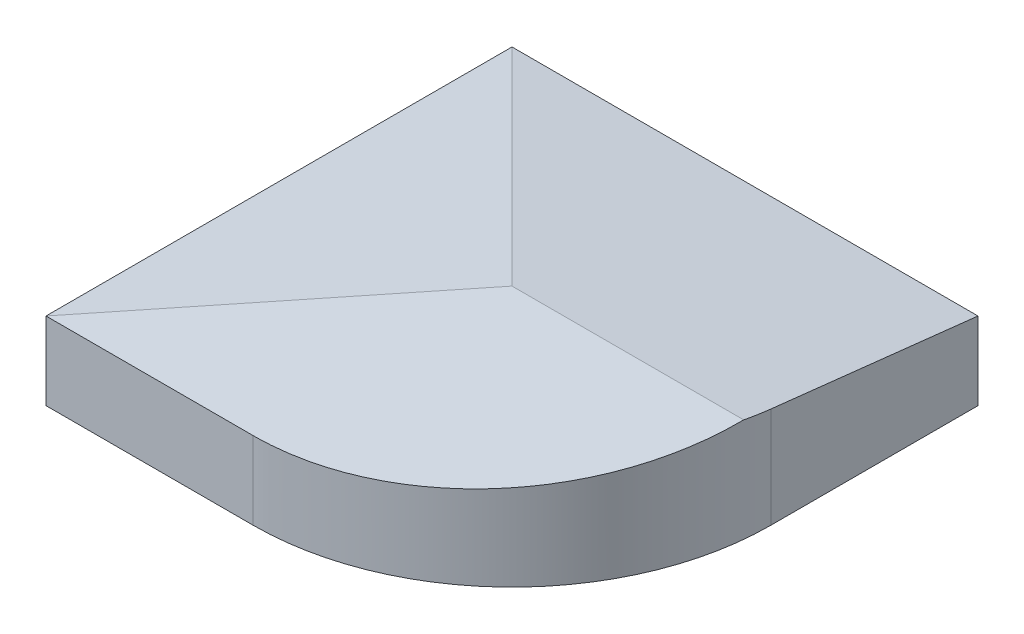
ISO-10303-21;
HEADER;
FILE_DESCRIPTION(('STEP AP214'),'2;1');
FILE_NAME('part.step','',(''),(''),'','','');
FILE_SCHEMA(('AUTOMOTIVE_DESIGN { 1 0 10303 214 1 1 1 1 }'));
ENDSEC;
DATA;
#1=APPLICATION_CONTEXT('core data for automotive mechanical design processes');
#2=APPLICATION_PROTOCOL_DEFINITION('international standard','automotive_design',2000,#1);
#3=PRODUCT_CONTEXT('',#1,'mechanical');
#4=PRODUCT('Part','Part','',(#3));
#5=PRODUCT_RELATED_PRODUCT_CATEGORY('part','',(#4));
#6=PRODUCT_DEFINITION_FORMATION('','',#4);
#7=PRODUCT_DEFINITION_CONTEXT('part definition',#1,'design');
#8=PRODUCT_DEFINITION('design','',#6,#7);
#9=PRODUCT_DEFINITION_SHAPE('','',#8);
#10=(LENGTH_UNIT() NAMED_UNIT(*) SI_UNIT(.MILLI.,.METRE.));
#11=(NAMED_UNIT(*) PLANE_ANGLE_UNIT() SI_UNIT($,.RADIAN.));
#12=(NAMED_UNIT(*) SI_UNIT($,.STERADIAN.) SOLID_ANGLE_UNIT());
#13=UNCERTAINTY_MEASURE_WITH_UNIT(LENGTH_MEASURE(1.E-05),#10,'distance_accuracy_value','');
#14=(GEOMETRIC_REPRESENTATION_CONTEXT(3) GLOBAL_UNCERTAINTY_ASSIGNED_CONTEXT((#13)) GLOBAL_UNIT_ASSIGNED_CONTEXT((#10,
#11,#12)) REPRESENTATION_CONTEXT('',''));
#15=CARTESIAN_POINT('',(0.,0.,0.));
#16=DIRECTION('',(0.,0.,1.));
#17=DIRECTION('',(1.,0.,0.));
#18=AXIS2_PLACEMENT_3D('',#15,#16,#17);
#19=CARTESIAN_POINT('',(900.,200.,-900.));
#20=DIRECTION('',(0.,0.,1.));
#21=DIRECTION('',(1.,0.,0.));
#22=AXIS2_PLACEMENT_3D('',#19,#20,#21);
#23=PLANE('',#22);
#24=DIRECTION('',(0.,-1.,0.));
#25=VECTOR('',#24,1.);
#26=CARTESIAN_POINT('',(0.,200.,-900.));
#27=LINE('',#26,#25);
#28=CARTESIAN_POINT('',(0.,150.,-900.));
#29=VERTEX_POINT('',#28);
#30=CARTESIAN_POINT('',(0.,0.,-900.));
#31=VERTEX_POINT('',#30);
#32=EDGE_CURVE('E206',#29,#31,#27,.T.);
#33=ORIENTED_EDGE('',*,*,#32,.F.);
#34=DIRECTION('',(-1.,0.,0.));
#35=VECTOR('',#34,1.);
#36=CARTESIAN_POINT('',(900.,150.,-900.));
#37=LINE('',#36,#35);
#38=CARTESIAN_POINT('',(900.,150.,-900.));
#39=VERTEX_POINT('',#38);
#40=EDGE_CURVE('E186',#39,#29,#37,.T.);
#41=ORIENTED_EDGE('',*,*,#40,.F.);
#42=DIRECTION('',(0.,-1.,0.));
#43=VECTOR('',#42,1.);
#44=CARTESIAN_POINT('',(900.,200.,-900.));
#45=LINE('',#44,#43);
#46=CARTESIAN_POINT('',(900.,0.,-900.));
#47=VERTEX_POINT('',#46);
#48=EDGE_CURVE('E202',#39,#47,#45,.T.);
#49=ORIENTED_EDGE('',*,*,#48,.T.);
#50=DIRECTION('',(-1.,0.,0.));
#51=VECTOR('',#50,1.);
#52=CARTESIAN_POINT('',(900.,0.,-900.));
#53=LINE('',#52,#51);
#54=EDGE_CURVE('E189',#47,#31,#53,.T.);
#55=ORIENTED_EDGE('',*,*,#54,.T.);
#56=EDGE_LOOP('',(#33,#41,#49,#55));
#57=FACE_BOUND('',#56,.T.);
#58=ADVANCED_FACE('F33',(#57),#23,.F.);
#59=CARTESIAN_POINT('',(0.,200.,-900.));
#60=DIRECTION('',(1.,0.,0.));
#61=DIRECTION('',(0.,0.,-1.));
#62=AXIS2_PLACEMENT_3D('',#59,#60,#61);
#63=PLANE('',#62);
#64=DIRECTION('',(0.,-1.,0.));
#65=VECTOR('',#64,1.);
#66=CARTESIAN_POINT('',(0.,200.,0.));
#67=LINE('',#66,#65);
#68=CARTESIAN_POINT('',(0.,150.,0.));
#69=VERTEX_POINT('',#68);
#70=CARTESIAN_POINT('',(0.,0.,0.));
#71=VERTEX_POINT('',#70);
#72=EDGE_CURVE('E204',#69,#71,#67,.T.);
#73=ORIENTED_EDGE('',*,*,#72,.F.);
#74=DIRECTION('',(0.,0.,-1.));
#75=VECTOR('',#74,1.);
#76=CARTESIAN_POINT('',(0.,150.,1.11022302462516E-13));
#77=LINE('',#76,#75);
#78=EDGE_CURVE('E180',#69,#29,#77,.T.);
#79=ORIENTED_EDGE('',*,*,#78,.T.);
#80=ORIENTED_EDGE('',*,*,#32,.T.);
#81=DIRECTION('',(0.,0.,1.));
#82=VECTOR('',#81,1.);
#83=CARTESIAN_POINT('',(0.,0.,-900.));
#84=LINE('',#83,#82);
#85=EDGE_CURVE('E193',#31,#71,#84,.T.);
#86=ORIENTED_EDGE('',*,*,#85,.T.);
#87=EDGE_LOOP('',(#73,#79,#80,#86));
#88=FACE_BOUND('',#87,.T.);
#89=ADVANCED_FACE('F227',(#88),#63,.F.);
#90=CARTESIAN_POINT('',(900.,200.,0.));
#91=DIRECTION('',(0.,0.,-1.));
#92=DIRECTION('',(-1.,0.,0.));
#93=AXIS2_PLACEMENT_3D('',#90,#91,#92);
#94=PLANE('',#93);
#95=DIRECTION('',(0.,-1.,0.));
#96=VECTOR('',#95,1.);
#97=CARTESIAN_POINT('',(400.,200.,0.));
#98=LINE('',#97,#96);
#99=CARTESIAN_POINT('',(400.,0.,0.));
#100=VERTEX_POINT('',#99);
#101=CARTESIAN_POINT('',(400.,150.,0.));
#102=VERTEX_POINT('',#101);
#103=EDGE_CURVE('E212',#100,#102,#98,.F.);
#104=ORIENTED_EDGE('',*,*,#103,.T.);
#105=DIRECTION('',(1.,0.,0.));
#106=VECTOR('',#105,1.);
#107=CARTESIAN_POINT('',(0.,150.,0.));
#108=LINE('',#107,#106);
#109=EDGE_CURVE('E166',#69,#102,#108,.T.);
#110=ORIENTED_EDGE('',*,*,#109,.F.);
#111=ORIENTED_EDGE('',*,*,#72,.T.);
#112=DIRECTION('',(1.,0.,0.));
#113=VECTOR('',#112,1.);
#114=CARTESIAN_POINT('',(900.,0.,0.));
#115=LINE('',#114,#113);
#116=EDGE_CURVE('E196',#71,#100,#115,.T.);
#117=ORIENTED_EDGE('',*,*,#116,.T.);
#118=EDGE_LOOP('',(#104,#110,#111,#117));
#119=FACE_BOUND('',#118,.T.);
#120=ADVANCED_FACE('F232',(#119),#94,.F.);
#121=CARTESIAN_POINT('',(900.,200.,-900.));
#122=DIRECTION('',(-1.,0.,0.));
#123=DIRECTION('',(0.,0.,1.));
#124=AXIS2_PLACEMENT_3D('',#121,#122,#123);
#125=PLANE('',#124);
#126=ORIENTED_EDGE('',*,*,#48,.F.);
#127=DIRECTION('',(0.,0.110431526074847,0.993883734673619));
#128=VECTOR('',#127,1.);
#129=CARTESIAN_POINT('',(900.,200.,-450.));
#130=LINE('',#129,#128);
#131=CARTESIAN_POINT('',(900.,194.444444444444,-500.));
#132=VERTEX_POINT('',#131);
#133=EDGE_CURVE('E183',#39,#132,#130,.T.);
#134=ORIENTED_EDGE('',*,*,#133,.T.);
#135=DIRECTION('',(0.,-1.,0.));
#136=VECTOR('',#135,1.);
#137=CARTESIAN_POINT('',(900.,200.,-500.));
#138=LINE('',#137,#136);
#139=CARTESIAN_POINT('',(900.,0.,-500.));
#140=VERTEX_POINT('',#139);
#141=EDGE_CURVE('E208',#132,#140,#138,.T.);
#142=ORIENTED_EDGE('',*,*,#141,.T.);
#143=DIRECTION('',(0.,0.,-1.));
#144=VECTOR('',#143,1.);
#145=CARTESIAN_POINT('',(900.,0.,-900.));
#146=LINE('',#145,#144);
#147=EDGE_CURVE('E199',#140,#47,#146,.T.);
#148=ORIENTED_EDGE('',*,*,#147,.T.);
#149=EDGE_LOOP('',(#126,#134,#142,#148));
#150=FACE_BOUND('',#149,.T.);
#151=ADVANCED_FACE('F241',(#150),#125,.F.);
#152=CARTESIAN_POINT('',(0.,0.,0.));
#153=DIRECTION('',(0.,1.,0.));
#154=DIRECTION('',(0.,0.,1.));
#155=AXIS2_PLACEMENT_3D('',#152,#153,#154);
#156=PLANE('',#155);
#157=CARTESIAN_POINT('',(400.,0.,-500.));
#158=DIRECTION('',(0.,1.,0.));
#159=DIRECTION('',(0.,0.,1.));
#160=AXIS2_PLACEMENT_3D('',#157,#158,#159);
#161=CIRCLE('',#160,430.);
#162=CARTESIAN_POINT('',(830.,0.,-500.));
#163=VERTEX_POINT('',#162);
#164=CARTESIAN_POINT('',(400.,0.,-70.));
#165=VERTEX_POINT('',#164);
#166=EDGE_CURVE('E145',#163,#165,#161,.F.);
#167=ORIENTED_EDGE('',*,*,#166,.F.);
#168=DIRECTION('',(0.,0.,-1.));
#169=VECTOR('',#168,1.);
#170=CARTESIAN_POINT('',(830.,0.,-900.));
#171=LINE('',#170,#169);
#172=CARTESIAN_POINT('',(830.,0.,-830.));
#173=VERTEX_POINT('',#172);
#174=EDGE_CURVE('E170',#163,#173,#171,.T.);
#175=ORIENTED_EDGE('',*,*,#174,.T.);
#176=DIRECTION('',(-1.,0.,0.));
#177=VECTOR('',#176,1.);
#178=CARTESIAN_POINT('',(900.,0.,-830.));
#179=LINE('',#178,#177);
#180=CARTESIAN_POINT('',(70.,0.,-830.));
#181=VERTEX_POINT('',#180);
#182=EDGE_CURVE('E167',#173,#181,#179,.T.);
#183=ORIENTED_EDGE('',*,*,#182,.T.);
#184=DIRECTION('',(0.,0.,1.));
#185=VECTOR('',#184,1.);
#186=CARTESIAN_POINT('',(70.,0.,-900.));
#187=LINE('',#186,#185);
#188=CARTESIAN_POINT('',(70.,0.,-70.));
#189=VERTEX_POINT('',#188);
#190=EDGE_CURVE('E48',#181,#189,#187,.T.);
#191=ORIENTED_EDGE('',*,*,#190,.T.);
#192=DIRECTION('',(1.,0.,0.));
#193=VECTOR('',#192,1.);
#194=CARTESIAN_POINT('',(900.,0.,-70.));
#195=LINE('',#194,#193);
#196=EDGE_CURVE('E173',#189,#165,#195,.T.);
#197=ORIENTED_EDGE('',*,*,#196,.T.);
#198=EDGE_LOOP('',(#167,#175,#183,#191,#197));
#199=FACE_BOUND('',#198,.T.);
#200=ORIENTED_EDGE('',*,*,#147,.F.);
#201=CARTESIAN_POINT('',(400.,0.,-500.));
#202=DIRECTION('',(0.,1.,0.));
#203=DIRECTION('',(0.,0.,1.));
#204=AXIS2_PLACEMENT_3D('',#201,#202,#203);
#205=CIRCLE('',#204,500.);
#206=EDGE_CURVE('E210',#140,#100,#205,.F.);
#207=ORIENTED_EDGE('',*,*,#206,.T.);
#208=ORIENTED_EDGE('',*,*,#116,.F.);
#209=ORIENTED_EDGE('',*,*,#85,.F.);
#210=ORIENTED_EDGE('',*,*,#54,.F.);
#211=EDGE_LOOP('',(#200,#207,#208,#209,#210));
#212=FACE_BOUND('',#211,.T.);
#213=ADVANCED_FACE('F246',(#199,#212),#156,.F.);
#214=CARTESIAN_POINT('',(400.,200.,-500.));
#215=DIRECTION('',(0.,-1.,0.));
#216=DIRECTION('',(0.,0.,-1.));
#217=AXIS2_PLACEMENT_3D('',#214,#215,#216);
#218=CYLINDRICAL_SURFACE('',#217,500.);
#219=CARTESIAN_POINT('',(400.,205.555555555556,-500.));
#220=DIRECTION('',(0.,-0.993883734673619,-0.110431526074847));
#221=DIRECTION('',(0.,-0.110431526074847,0.993883734673619));
#222=AXIS2_PLACEMENT_3D('',#219,#220,#221);
#223=ELLIPSE('',#222,503.076952118745,500.);
#224=CARTESIAN_POINT('',(897.49371855331,200.,-450.));
#225=VERTEX_POINT('',#224);
#226=EDGE_CURVE('E178',#102,#225,#223,.F.);
#227=ORIENTED_EDGE('',*,*,#226,.F.);
#228=ORIENTED_EDGE('',*,*,#103,.F.);
#229=ORIENTED_EDGE('',*,*,#206,.F.);
#230=ORIENTED_EDGE('',*,*,#141,.F.);
#231=CARTESIAN_POINT('',(400.,194.444444444444,-500.));
#232=DIRECTION('',(0.,-0.993883734673619,0.110431526074847));
#233=DIRECTION('',(0.,-0.110431526074847,-0.993883734673619));
#234=AXIS2_PLACEMENT_3D('',#231,#232,#233);
#235=ELLIPSE('',#234,503.076952118745,500.);
#236=EDGE_CURVE('E215',#225,#132,#235,.F.);
#237=ORIENTED_EDGE('',*,*,#236,.F.);
#238=EDGE_LOOP('',(#227,#228,#229,#230,#237));
#239=FACE_BOUND('',#238,.T.);
#240=ADVANCED_FACE('F35',(#239),#218,.T.);
#241=CARTESIAN_POINT('',(900.,200.,-450.));
#242=DIRECTION('',(0.,-0.993883734673619,0.110431526074847));
#243=DIRECTION('',(0.,-0.110431526074847,-0.993883734673619));
#244=AXIS2_PLACEMENT_3D('',#241,#242,#243);
#245=PLANE('',#244);
#246=ORIENTED_EDGE('',*,*,#40,.T.);
#247=DIRECTION('',(0.704934404989162,0.0783260449987957,0.704934404989161));
#248=VECTOR('',#247,1.);
#249=CARTESIAN_POINT('',(673.619631901841,224.846625766871,-226.38036809816));
#250=LINE('',#249,#248);
#251=CARTESIAN_POINT('',(450.,200.,-450.));
#252=VERTEX_POINT('',#251);
#253=EDGE_CURVE('E41',#29,#252,#250,.T.);
#254=ORIENTED_EDGE('',*,*,#253,.T.);
#255=DIRECTION('',(-1.,0.,0.));
#256=VECTOR('',#255,1.);
#257=CARTESIAN_POINT('',(900.,200.,-450.));
#258=LINE('',#257,#256);
#259=EDGE_CURVE('E56',#225,#252,#258,.T.);
#260=ORIENTED_EDGE('',*,*,#259,.F.);
#261=ORIENTED_EDGE('',*,*,#236,.T.);
#262=ORIENTED_EDGE('',*,*,#133,.F.);
#263=EDGE_LOOP('',(#246,#254,#260,#261,#262));
#264=FACE_BOUND('',#263,.T.);
#265=ADVANCED_FACE('F218',(#264),#245,.F.);
#266=CARTESIAN_POINT('',(450.,200.,0.));
#267=DIRECTION('',(0.110431526074846,-0.993883734673619,0.));
#268=DIRECTION('',(0.993883734673619,0.110431526074846,0.));
#269=AXIS2_PLACEMENT_3D('',#266,#267,#268);
#270=PLANE('',#269);
#271=ORIENTED_EDGE('',*,*,#78,.F.);
#272=DIRECTION('',(0.704934404989162,0.0783260449987957,-0.704934404989161));
#273=VECTOR('',#272,1.);
#274=CARTESIAN_POINT('',(226.38036809816,175.153374233129,-226.38036809816));
#275=LINE('',#274,#273);
#276=EDGE_CURVE('E11',#69,#252,#275,.T.);
#277=ORIENTED_EDGE('',*,*,#276,.T.);
#278=ORIENTED_EDGE('',*,*,#253,.F.);
#279=EDGE_LOOP('',(#271,#277,#278));
#280=FACE_BOUND('',#279,.T.);
#281=ADVANCED_FACE('F224',(#280),#270,.F.);
#282=CARTESIAN_POINT('',(0.,150.,0.));
#283=DIRECTION('',(0.,-0.993883734673619,-0.110431526074847));
#284=DIRECTION('',(0.,0.110431526074847,-0.993883734673619));
#285=AXIS2_PLACEMENT_3D('',#282,#283,#284);
#286=PLANE('',#285);
#287=ORIENTED_EDGE('',*,*,#226,.T.);
#288=ORIENTED_EDGE('',*,*,#259,.T.);
#289=ORIENTED_EDGE('',*,*,#276,.F.);
#290=ORIENTED_EDGE('',*,*,#109,.T.);
#291=EDGE_LOOP('',(#287,#288,#289,#290));
#292=FACE_BOUND('',#291,.T.);
#293=ADVANCED_FACE('F235',(#292),#286,.F.);
#294=CARTESIAN_POINT('',(900.,200.,-830.));
#295=DIRECTION('',(0.,0.,1.));
#296=DIRECTION('',(1.,0.,0.));
#297=AXIS2_PLACEMENT_3D('',#294,#295,#296);
#298=PLANE('',#297);
#299=DIRECTION('',(0.,-1.,0.));
#300=VECTOR('',#299,1.);
#301=CARTESIAN_POINT('',(70.,200.,-830.));
#302=LINE('',#301,#300);
#303=CARTESIAN_POINT('',(70.0000000000001,137.654699693028,-830.));
#304=VERTEX_POINT('',#303);
#305=EDGE_CURVE('E155',#304,#181,#302,.T.);
#306=ORIENTED_EDGE('',*,*,#305,.T.);
#307=ORIENTED_EDGE('',*,*,#182,.F.);
#308=DIRECTION('',(0.,-1.,0.));
#309=VECTOR('',#308,1.);
#310=CARTESIAN_POINT('',(830.,200.,-830.));
#311=LINE('',#310,#309);
#312=CARTESIAN_POINT('',(830.,137.654699693028,-830.));
#313=VERTEX_POINT('',#312);
#314=EDGE_CURVE('E172',#313,#173,#311,.T.);
#315=ORIENTED_EDGE('',*,*,#314,.F.);
#316=DIRECTION('',(-1.,0.,0.));
#317=VECTOR('',#316,1.);
#318=CARTESIAN_POINT('',(900.,137.654699693028,-830.));
#319=LINE('',#318,#317);
#320=EDGE_CURVE('E164',#313,#304,#319,.T.);
#321=ORIENTED_EDGE('',*,*,#320,.T.);
#322=EDGE_LOOP('',(#306,#307,#315,#321));
#323=FACE_BOUND('',#322,.T.);
#324=ADVANCED_FACE('F314',(#323),#298,.T.);
#325=CARTESIAN_POINT('',(70.,200.,-900.));
#326=DIRECTION('',(1.,0.,0.));
#327=DIRECTION('',(0.,0.,-1.));
#328=AXIS2_PLACEMENT_3D('',#325,#326,#327);
#329=PLANE('',#328);
#330=DIRECTION('',(0.,-1.,0.));
#331=VECTOR('',#330,1.);
#332=CARTESIAN_POINT('',(70.,200.,-70.));
#333=LINE('',#332,#331);
#334=CARTESIAN_POINT('',(70.,137.654699693028,-69.9999999999999));
#335=VERTEX_POINT('',#334);
#336=EDGE_CURVE('E130',#335,#189,#333,.T.);
#337=ORIENTED_EDGE('',*,*,#336,.T.);
#338=ORIENTED_EDGE('',*,*,#190,.F.);
#339=ORIENTED_EDGE('',*,*,#305,.F.);
#340=DIRECTION('',(0.,0.,-1.));
#341=VECTOR('',#340,1.);
#342=CARTESIAN_POINT('',(70.,137.654699693028,-900.));
#343=LINE('',#342,#341);
#344=EDGE_CURVE('E141',#335,#304,#343,.T.);
#345=ORIENTED_EDGE('',*,*,#344,.F.);
#346=EDGE_LOOP('',(#337,#338,#339,#345));
#347=FACE_BOUND('',#346,.T.);
#348=ADVANCED_FACE('F321',(#347),#329,.T.);
#349=CARTESIAN_POINT('',(900.,200.,-70.));
#350=DIRECTION('',(0.,0.,-1.));
#351=DIRECTION('',(-1.,0.,0.));
#352=AXIS2_PLACEMENT_3D('',#349,#350,#351);
#353=PLANE('',#352);
#354=DIRECTION('',(0.,1.,0.));
#355=VECTOR('',#354,1.);
#356=CARTESIAN_POINT('',(400.,200.,-70.));
#357=LINE('',#356,#355);
#358=CARTESIAN_POINT('',(400.,137.654699693028,-70.));
#359=VERTEX_POINT('',#358);
#360=EDGE_CURVE('E128',#165,#359,#357,.T.);
#361=ORIENTED_EDGE('',*,*,#360,.F.);
#362=ORIENTED_EDGE('',*,*,#196,.F.);
#363=ORIENTED_EDGE('',*,*,#336,.F.);
#364=DIRECTION('',(1.,0.,0.));
#365=VECTOR('',#364,1.);
#366=CARTESIAN_POINT('',(0.,137.654699693028,-70.));
#367=LINE('',#366,#365);
#368=EDGE_CURVE('E123',#335,#359,#367,.T.);
#369=ORIENTED_EDGE('',*,*,#368,.T.);
#370=EDGE_LOOP('',(#361,#362,#363,#369));
#371=FACE_BOUND('',#370,.T.);
#372=ADVANCED_FACE('F125',(#371),#353,.T.);
#373=CARTESIAN_POINT('',(830.,200.,-900.));
#374=DIRECTION('',(-1.,0.,0.));
#375=DIRECTION('',(0.,0.,1.));
#376=AXIS2_PLACEMENT_3D('',#373,#374,#375);
#377=PLANE('',#376);
#378=ORIENTED_EDGE('',*,*,#314,.T.);
#379=ORIENTED_EDGE('',*,*,#174,.F.);
#380=DIRECTION('',(0.,1.,0.));
#381=VECTOR('',#380,1.);
#382=CARTESIAN_POINT('',(830.,200.,-500.));
#383=LINE('',#382,#381);
#384=CARTESIAN_POINT('',(830.,174.321366359695,-500.));
#385=VERTEX_POINT('',#384);
#386=EDGE_CURVE('E150',#385,#163,#383,.F.);
#387=ORIENTED_EDGE('',*,*,#386,.F.);
#388=DIRECTION('',(0.,0.110431526074847,0.993883734673619));
#389=VECTOR('',#388,1.);
#390=CARTESIAN_POINT('',(830.,130.732081404089,-892.303564600454));
#391=LINE('',#390,#389);
#392=EDGE_CURVE('E157',#313,#385,#391,.T.);
#393=ORIENTED_EDGE('',*,*,#392,.F.);
#394=EDGE_LOOP('',(#378,#379,#387,#393));
#395=FACE_BOUND('',#394,.T.);
#396=ADVANCED_FACE('F337',(#395),#377,.T.);
#397=CARTESIAN_POINT('',(400.,200.,-500.));
#398=DIRECTION('',(0.,-1.,0.));
#399=DIRECTION('',(0.,0.,-1.));
#400=AXIS2_PLACEMENT_3D('',#397,#398,#399);
#401=CYLINDRICAL_SURFACE('',#400,430.);
#402=CARTESIAN_POINT('',(400.,185.432477470806,-500.));
#403=DIRECTION('',(0.,-0.993883734673619,-0.110431526074847));
#404=DIRECTION('',(0.,-0.110431526074847,0.993883734673619));
#405=AXIS2_PLACEMENT_3D('',#402,#403,#404);
#406=ELLIPSE('',#405,432.646178822121,430.);
#407=CARTESIAN_POINT('',(827.083130081252,179.87692191525,-450.));
#408=VERTEX_POINT('',#407);
#409=EDGE_CURVE('E134',#359,#408,#406,.F.);
#410=ORIENTED_EDGE('',*,*,#409,.T.);
#411=CARTESIAN_POINT('',(400.,174.321366359695,-500.));
#412=DIRECTION('',(0.,-0.993883734673619,0.110431526074847));
#413=DIRECTION('',(0.,-0.110431526074847,-0.993883734673619));
#414=AXIS2_PLACEMENT_3D('',#411,#412,#413);
#415=ELLIPSE('',#414,432.646178822121,430.);
#416=EDGE_CURVE('E146',#408,#385,#415,.F.);
#417=ORIENTED_EDGE('',*,*,#416,.T.);
#418=ORIENTED_EDGE('',*,*,#386,.T.);
#419=ORIENTED_EDGE('',*,*,#166,.T.);
#420=ORIENTED_EDGE('',*,*,#360,.T.);
#421=EDGE_LOOP('',(#410,#417,#418,#419,#420));
#422=FACE_BOUND('',#421,.T.);
#423=ADVANCED_FACE('F143',(#422),#401,.F.);
#424=CARTESIAN_POINT('',(900.,180.122325306528,-447.791369478503));
#425=DIRECTION('',(0.,-0.993883734673619,0.110431526074847));
#426=DIRECTION('',(0.,-0.110431526074847,-0.993883734673619));
#427=AXIS2_PLACEMENT_3D('',#424,#425,#426);
#428=PLANE('',#427);
#429=ORIENTED_EDGE('',*,*,#320,.F.);
#430=ORIENTED_EDGE('',*,*,#392,.T.);
#431=ORIENTED_EDGE('',*,*,#416,.F.);
#432=DIRECTION('',(-1.,0.,0.));
#433=VECTOR('',#432,1.);
#434=CARTESIAN_POINT('',(0.,179.87692191525,-450.));
#435=LINE('',#434,#433);
#436=CARTESIAN_POINT('',(450.000000000001,179.87692191525,-450.));
#437=VERTEX_POINT('',#436);
#438=EDGE_CURVE('E138',#408,#437,#435,.T.);
#439=ORIENTED_EDGE('',*,*,#438,.T.);
#440=DIRECTION('',(0.704934404989162,0.0783260449987957,0.704934404989161));
#441=VECTOR('',#440,1.);
#442=CARTESIAN_POINT('',(674.73072210284,204.847002148899,-225.269277897161));
#443=LINE('',#442,#441);
#444=EDGE_CURVE('E148',#304,#437,#443,.T.);
#445=ORIENTED_EDGE('',*,*,#444,.F.);
#446=EDGE_LOOP('',(#429,#430,#431,#439,#445));
#447=FACE_BOUND('',#446,.T.);
#448=ADVANCED_FACE('F353',(#447),#428,.T.);
#449=CARTESIAN_POINT('',(452.208630521497,180.122325306528,0.));
#450=DIRECTION('',(0.110431526074846,-0.993883734673619,0.));
#451=DIRECTION('',(0.993883734673619,0.110431526074846,0.));
#452=AXIS2_PLACEMENT_3D('',#449,#450,#451);
#453=PLANE('',#452);
#454=ORIENTED_EDGE('',*,*,#344,.T.);
#455=ORIENTED_EDGE('',*,*,#444,.T.);
#456=DIRECTION('',(0.704934404989162,0.0783260449987957,-0.704934404989161));
#457=VECTOR('',#456,1.);
#458=CARTESIAN_POINT('',(227.491458299158,155.153750615157,-227.491458299158));
#459=LINE('',#458,#457);
#460=EDGE_CURVE('E162',#335,#437,#459,.T.);
#461=ORIENTED_EDGE('',*,*,#460,.F.);
#462=EDGE_LOOP('',(#454,#455,#461));
#463=FACE_BOUND('',#462,.T.);
#464=ADVANCED_FACE('F361',(#463),#453,.T.);
#465=CARTESIAN_POINT('',(0.,130.122325306528,-2.20863052149694));
#466=DIRECTION('',(0.,-0.993883734673619,-0.110431526074847));
#467=DIRECTION('',(0.,0.110431526074847,-0.993883734673619));
#468=AXIS2_PLACEMENT_3D('',#465,#466,#467);
#469=PLANE('',#468);
#470=ORIENTED_EDGE('',*,*,#409,.F.);
#471=ORIENTED_EDGE('',*,*,#368,.F.);
#472=ORIENTED_EDGE('',*,*,#460,.T.);
#473=ORIENTED_EDGE('',*,*,#438,.F.);
#474=EDGE_LOOP('',(#470,#471,#472,#473));
#475=FACE_BOUND('',#474,.T.);
#476=ADVANCED_FACE('F137',(#475),#469,.T.);
#477=CLOSED_SHELL('',(#58,#89,#120,#151,#213,#240,#265,#281,#293,#324,#348,#372,#396,#423,#448,
#464,#476));
#478=MANIFOLD_SOLID_BREP('B2',#477);
#479=ADVANCED_BREP_SHAPE_REPRESENTATION('',(#18,#478),#14);
#480=SHAPE_DEFINITION_REPRESENTATION(#9,#479);
ENDSEC;
END-ISO-10303-21;
